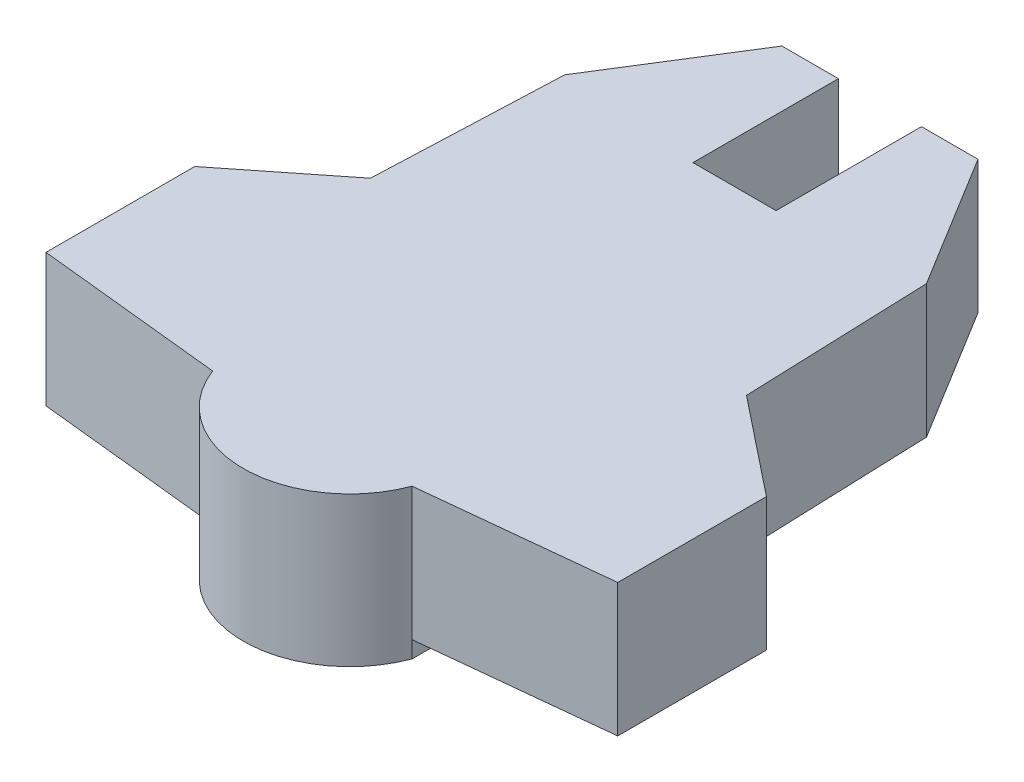
ISO-10303-21;
HEADER;
FILE_DESCRIPTION(('STEP AP214'),'2;1');
FILE_NAME('part.step','',(''),(''),'','','');
FILE_SCHEMA(('AUTOMOTIVE_DESIGN { 1 0 10303 214 1 1 1 1 }'));
ENDSEC;
DATA;
#1=APPLICATION_CONTEXT('core data for automotive mechanical design processes');
#2=APPLICATION_PROTOCOL_DEFINITION('international standard','automotive_design',2000,#1);
#3=PRODUCT_CONTEXT('',#1,'mechanical');
#4=PRODUCT('Part','Part','',(#3));
#5=PRODUCT_RELATED_PRODUCT_CATEGORY('part','',(#4));
#6=PRODUCT_DEFINITION_FORMATION('','',#4);
#7=PRODUCT_DEFINITION_CONTEXT('part definition',#1,'design');
#8=PRODUCT_DEFINITION('design','',#6,#7);
#9=PRODUCT_DEFINITION_SHAPE('','',#8);
#10=(LENGTH_UNIT() NAMED_UNIT(*) SI_UNIT(.MILLI.,.METRE.));
#11=(NAMED_UNIT(*) PLANE_ANGLE_UNIT() SI_UNIT($,.RADIAN.));
#12=(NAMED_UNIT(*) SI_UNIT($,.STERADIAN.) SOLID_ANGLE_UNIT());
#13=UNCERTAINTY_MEASURE_WITH_UNIT(LENGTH_MEASURE(1.E-05),#10,'distance_accuracy_value','');
#14=(GEOMETRIC_REPRESENTATION_CONTEXT(3) GLOBAL_UNCERTAINTY_ASSIGNED_CONTEXT((#13)) GLOBAL_UNIT_ASSIGNED_CONTEXT((#10,
#11,#12)) REPRESENTATION_CONTEXT('',''));
#15=CARTESIAN_POINT('',(0.,0.,0.));
#16=DIRECTION('',(0.,0.,1.));
#17=DIRECTION('',(1.,0.,0.));
#18=AXIS2_PLACEMENT_3D('',#15,#16,#17);
#19=CARTESIAN_POINT('',(21.4236315388932,9.,-58.3331963393979));
#20=DIRECTION('',(0.103828722380612,0.,-0.994595192230894));
#21=DIRECTION('',(-0.994595192230895,0.,-0.103828722380612));
#22=AXIS2_PLACEMENT_3D('',#19,#20,#21);
#23=PLANE('',#22);
#24=DIRECTION('',(0.,-1.,0.));
#25=VECTOR('',#24,1.);
#26=CARTESIAN_POINT('',(21.4236315388932,9.,-58.3331963393979));
#27=LINE('',#26,#25);
#28=CARTESIAN_POINT('',(21.4236315388932,9.,-58.3331963393979));
#29=VERTEX_POINT('',#28);
#30=CARTESIAN_POINT('',(21.4236315388932,1.,-58.3331963393979));
#31=VERTEX_POINT('',#30);
#32=EDGE_CURVE('E41',#29,#31,#27,.T.);
#33=ORIENTED_EDGE('',*,*,#32,.T.);
#34=DIRECTION('',(-0.994595192230894,0.,-0.103828722380612));
#35=VECTOR('',#34,1.);
#36=CARTESIAN_POINT('',(32.6236315388932,1.,-57.1639953421012));
#37=LINE('',#36,#35);
#38=CARTESIAN_POINT('',(32.6236315388932,1.,-57.1639953421012));
#39=VERTEX_POINT('',#38);
#40=EDGE_CURVE('E208',#39,#31,#37,.T.);
#41=ORIENTED_EDGE('',*,*,#40,.F.);
#42=DIRECTION('',(0.,-1.,0.));
#43=VECTOR('',#42,1.);
#44=CARTESIAN_POINT('',(32.6236315388932,9.,-57.1639953421012));
#45=LINE('',#44,#43);
#46=CARTESIAN_POINT('',(32.6236315388932,9.,-57.1639953421012));
#47=VERTEX_POINT('',#46);
#48=EDGE_CURVE('E200',#47,#39,#45,.T.);
#49=ORIENTED_EDGE('',*,*,#48,.F.);
#50=DIRECTION('',(0.994595192230894,0.,0.103828722380612));
#51=VECTOR('',#50,1.);
#52=CARTESIAN_POINT('',(21.4236315388932,9.,-58.3331963393979));
#53=LINE('',#52,#51);
#54=EDGE_CURVE('E209',#29,#47,#53,.T.);
#55=ORIENTED_EDGE('',*,*,#54,.F.);
#56=EDGE_LOOP('',(#33,#41,#49,#55));
#57=FACE_BOUND('',#56,.T.);
#58=ADVANCED_FACE('F33',(#57),#23,.F.);
#59=CARTESIAN_POINT('',(38.6236315388932,9.,-59.411070601111));
#60=DIRECTION('',(0.,-1.,0.));
#61=DIRECTION('',(0.,0.,-1.));
#62=AXIS2_PLACEMENT_3D('',#59,#60,#61);
#63=CYLINDRICAL_SURFACE('',#62,6.40697644912589);
#64=CARTESIAN_POINT('',(38.6236315388932,0.,-59.411070601111));
#65=DIRECTION('',(0.,1.,0.));
#66=DIRECTION('',(0.,0.,1.));
#67=AXIS2_PLACEMENT_3D('',#64,#65,#66);
#68=CIRCLE('',#67,6.40697644912589);
#69=CARTESIAN_POINT('',(32.6236315388932,0.,-57.1639953421012));
#70=VERTEX_POINT('',#69);
#71=CARTESIAN_POINT('',(44.6236315388932,0.,-57.1639953421013));
#72=VERTEX_POINT('',#71);
#73=EDGE_CURVE('E160',#70,#72,#68,.T.);
#74=ORIENTED_EDGE('',*,*,#73,.T.);
#75=DIRECTION('',(0.,-1.,0.));
#76=VECTOR('',#75,1.);
#77=CARTESIAN_POINT('',(44.6236315388932,1.,-57.1639953421013));
#78=LINE('',#77,#76);
#79=CARTESIAN_POINT('',(44.6236315388932,1.,-57.1639953421013));
#80=VERTEX_POINT('',#79);
#81=EDGE_CURVE('E62',#80,#72,#78,.T.);
#82=ORIENTED_EDGE('',*,*,#81,.F.);
#83=DIRECTION('',(0.,-1.,0.));
#84=VECTOR('',#83,1.);
#85=CARTESIAN_POINT('',(44.6236315388932,9.,-57.1639953421013));
#86=LINE('',#85,#84);
#87=CARTESIAN_POINT('',(44.6236315388932,9.,-57.1639953421013));
#88=VERTEX_POINT('',#87);
#89=EDGE_CURVE('E197',#88,#80,#86,.T.);
#90=ORIENTED_EDGE('',*,*,#89,.F.);
#91=CARTESIAN_POINT('',(38.6236315388932,9.,-59.411070601111));
#92=DIRECTION('',(0.,1.,0.));
#93=DIRECTION('',(0.,0.,1.));
#94=AXIS2_PLACEMENT_3D('',#91,#92,#93);
#95=CIRCLE('',#94,6.40697644912589);
#96=EDGE_CURVE('E254',#47,#88,#95,.T.);
#97=ORIENTED_EDGE('',*,*,#96,.F.);
#98=ORIENTED_EDGE('',*,*,#48,.T.);
#99=DIRECTION('',(0.,-1.,0.));
#100=VECTOR('',#99,1.);
#101=CARTESIAN_POINT('',(32.6236315388932,1.,-57.1639953421012));
#102=LINE('',#101,#100);
#103=EDGE_CURVE('E239',#39,#70,#102,.T.);
#104=ORIENTED_EDGE('',*,*,#103,.T.);
#105=EDGE_LOOP('',(#74,#82,#90,#97,#98,#104));
#106=FACE_BOUND('',#105,.T.);
#107=ADVANCED_FACE('F343',(#106),#63,.T.);
#108=CARTESIAN_POINT('',(55.8236315388932,9.,-58.3331963393979));
#109=DIRECTION('',(-0.103828722380611,0.,-0.994595192230894));
#110=DIRECTION('',(-0.994595192230895,0.,0.103828722380611));
#111=AXIS2_PLACEMENT_3D('',#108,#109,#110);
#112=PLANE('',#111);
#113=ORIENTED_EDGE('',*,*,#89,.T.);
#114=DIRECTION('',(-0.994595192230895,0.,0.103828722380611));
#115=VECTOR('',#114,1.);
#116=CARTESIAN_POINT('',(55.8236315388932,1.,-58.3331963393979));
#117=LINE('',#116,#115);
#118=CARTESIAN_POINT('',(55.8236315388932,1.,-58.3331963393979));
#119=VERTEX_POINT('',#118);
#120=EDGE_CURVE('E331',#119,#80,#117,.T.);
#121=ORIENTED_EDGE('',*,*,#120,.F.);
#122=DIRECTION('',(0.,-1.,0.));
#123=VECTOR('',#122,1.);
#124=CARTESIAN_POINT('',(55.8236315388932,9.,-58.3331963393979));
#125=LINE('',#124,#123);
#126=CARTESIAN_POINT('',(55.8236315388932,9.,-58.3331963393979));
#127=VERTEX_POINT('',#126);
#128=EDGE_CURVE('E194',#127,#119,#125,.T.);
#129=ORIENTED_EDGE('',*,*,#128,.F.);
#130=DIRECTION('',(0.994595192230895,0.,-0.103828722380611));
#131=VECTOR('',#130,1.);
#132=CARTESIAN_POINT('',(55.8236315388932,9.,-58.3331963393979));
#133=LINE('',#132,#131);
#134=EDGE_CURVE('E256',#88,#127,#133,.T.);
#135=ORIENTED_EDGE('',*,*,#134,.F.);
#136=EDGE_LOOP('',(#113,#121,#129,#135));
#137=FACE_BOUND('',#136,.T.);
#138=ADVANCED_FACE('F348',(#137),#112,.F.);
#139=CARTESIAN_POINT('',(55.8236315388932,9.,-67.2801257100161));
#140=DIRECTION('',(-1.,0.,0.));
#141=DIRECTION('',(0.,0.,1.));
#142=AXIS2_PLACEMENT_3D('',#139,#140,#141);
#143=PLANE('',#142);
#144=ORIENTED_EDGE('',*,*,#128,.T.);
#145=DIRECTION('',(0.,0.,1.));
#146=VECTOR('',#145,1.);
#147=CARTESIAN_POINT('',(55.8236315388932,1.,-67.2801257100161));
#148=LINE('',#147,#146);
#149=CARTESIAN_POINT('',(55.8236315388932,1.,-67.2801257100161));
#150=VERTEX_POINT('',#149);
#151=EDGE_CURVE('E336',#150,#119,#148,.T.);
#152=ORIENTED_EDGE('',*,*,#151,.F.);
#153=DIRECTION('',(0.,-1.,0.));
#154=VECTOR('',#153,1.);
#155=CARTESIAN_POINT('',(55.8236315388932,9.,-67.2801257100161));
#156=LINE('',#155,#154);
#157=CARTESIAN_POINT('',(55.8236315388932,9.,-67.2801257100161));
#158=VERTEX_POINT('',#157);
#159=EDGE_CURVE('E191',#158,#150,#156,.T.);
#160=ORIENTED_EDGE('',*,*,#159,.F.);
#161=DIRECTION('',(0.,0.,-1.));
#162=VECTOR('',#161,1.);
#163=CARTESIAN_POINT('',(55.8236315388932,9.,-67.2801257100161));
#164=LINE('',#163,#162);
#165=EDGE_CURVE('E258',#127,#158,#164,.T.);
#166=ORIENTED_EDGE('',*,*,#165,.F.);
#167=EDGE_LOOP('',(#144,#152,#160,#166));
#168=FACE_BOUND('',#167,.T.);
#169=ADVANCED_FACE('F397',(#168),#143,.F.);
#170=CARTESIAN_POINT('',(49.9482892828328,9.,-71.9569296992029));
#171=DIRECTION('',(-0.622787478423044,0.,0.7823910510221));
#172=DIRECTION('',(0.7823910510221,0.,0.622787478423044));
#173=AXIS2_PLACEMENT_3D('',#170,#171,#172);
#174=PLANE('',#173);
#175=ORIENTED_EDGE('',*,*,#159,.T.);
#176=DIRECTION('',(0.7823910510221,0.,0.622787478423044));
#177=VECTOR('',#176,1.);
#178=CARTESIAN_POINT('',(49.9482892828328,1.,-71.9569296992029));
#179=LINE('',#178,#177);
#180=CARTESIAN_POINT('',(49.9482892828328,1.,-71.9569296992029));
#181=VERTEX_POINT('',#180);
#182=EDGE_CURVE('E391',#181,#150,#179,.T.);
#183=ORIENTED_EDGE('',*,*,#182,.F.);
#184=DIRECTION('',(0.,-1.,0.));
#185=VECTOR('',#184,1.);
#186=CARTESIAN_POINT('',(49.9482892828328,9.,-71.9569296992029));
#187=LINE('',#186,#185);
#188=CARTESIAN_POINT('',(49.9482892828328,9.,-71.9569296992029));
#189=VERTEX_POINT('',#188);
#190=EDGE_CURVE('E188',#189,#181,#187,.T.);
#191=ORIENTED_EDGE('',*,*,#190,.F.);
#192=DIRECTION('',(-0.7823910510221,0.,-0.622787478423044));
#193=VECTOR('',#192,1.);
#194=CARTESIAN_POINT('',(49.9482892828328,9.,-71.9569296992029));
#195=LINE('',#194,#193);
#196=EDGE_CURVE('E260',#158,#189,#195,.T.);
#197=ORIENTED_EDGE('',*,*,#196,.F.);
#198=EDGE_LOOP('',(#175,#183,#191,#197));
#199=FACE_BOUND('',#198,.T.);
#200=ADVANCED_FACE('F399',(#199),#174,.F.);
#201=CARTESIAN_POINT('',(49.5416106750775,9.,-83.191426238445));
#202=DIRECTION('',(-0.999345455962925,0.,0.0361754011208295));
#203=DIRECTION('',(0.0361754011208295,0.,0.999345455962925));
#204=AXIS2_PLACEMENT_3D('',#201,#202,#203);
#205=PLANE('',#204);
#206=ORIENTED_EDGE('',*,*,#190,.T.);
#207=DIRECTION('',(0.0361754011208295,0.,0.999345455962925));
#208=VECTOR('',#207,1.);
#209=CARTESIAN_POINT('',(49.5416106750775,1.,-83.191426238445));
#210=LINE('',#209,#208);
#211=CARTESIAN_POINT('',(49.5416106750775,1.,-83.191426238445));
#212=VERTEX_POINT('',#211);
#213=EDGE_CURVE('E390',#212,#181,#210,.T.);
#214=ORIENTED_EDGE('',*,*,#213,.F.);
#215=DIRECTION('',(0.,-1.,0.));
#216=VECTOR('',#215,1.);
#217=CARTESIAN_POINT('',(49.5416106750775,9.,-83.191426238445));
#218=LINE('',#217,#216);
#219=CARTESIAN_POINT('',(49.5416106750775,9.,-83.191426238445));
#220=VERTEX_POINT('',#219);
#221=EDGE_CURVE('E185',#220,#212,#218,.T.);
#222=ORIENTED_EDGE('',*,*,#221,.F.);
#223=DIRECTION('',(-0.0361754011208295,0.,-0.999345455962925));
#224=VECTOR('',#223,1.);
#225=CARTESIAN_POINT('',(49.5416106750775,9.,-83.191426238445));
#226=LINE('',#225,#224);
#227=EDGE_CURVE('E262',#189,#220,#226,.T.);
#228=ORIENTED_EDGE('',*,*,#227,.F.);
#229=EDGE_LOOP('',(#206,#214,#222,#228));
#230=FACE_BOUND('',#229,.T.);
#231=ADVANCED_FACE('F405',(#230),#205,.F.);
#232=CARTESIAN_POINT('',(44.6106325560436,9.,-91.2233287416136));
#233=DIRECTION('',(-0.852213418177229,0.,0.523194313691083));
#234=DIRECTION('',(0.523194313691083,0.,0.852213418177229));
#235=AXIS2_PLACEMENT_3D('',#232,#233,#234);
#236=PLANE('',#235);
#237=ORIENTED_EDGE('',*,*,#221,.T.);
#238=DIRECTION('',(0.523194313691083,0.,0.852213418177229));
#239=VECTOR('',#238,1.);
#240=CARTESIAN_POINT('',(44.6106325560436,1.,-91.2233287416136));
#241=LINE('',#240,#239);
#242=CARTESIAN_POINT('',(44.6106325560436,1.,-91.2233287416136));
#243=VERTEX_POINT('',#242);
#244=EDGE_CURVE('E386',#243,#212,#241,.T.);
#245=ORIENTED_EDGE('',*,*,#244,.F.);
#246=DIRECTION('',(0.,-1.,0.));
#247=VECTOR('',#246,1.);
#248=CARTESIAN_POINT('',(44.6106325560436,9.,-91.2233287416136));
#249=LINE('',#248,#247);
#250=CARTESIAN_POINT('',(44.6106325560436,9.,-91.2233287416136));
#251=VERTEX_POINT('',#250);
#252=EDGE_CURVE('E182',#251,#243,#249,.T.);
#253=ORIENTED_EDGE('',*,*,#252,.F.);
#254=DIRECTION('',(-0.523194313691083,0.,-0.852213418177229));
#255=VECTOR('',#254,1.);
#256=CARTESIAN_POINT('',(44.6106325560436,9.,-91.2233287416136));
#257=LINE('',#256,#255);
#258=EDGE_CURVE('E264',#220,#251,#257,.T.);
#259=ORIENTED_EDGE('',*,*,#258,.F.);
#260=EDGE_LOOP('',(#237,#245,#253,#259));
#261=FACE_BOUND('',#260,.T.);
#262=ADVANCED_FACE('F408',(#261),#236,.F.);
#263=CARTESIAN_POINT('',(41.2106325560436,9.,-91.2233287416136));
#264=DIRECTION('',(0.,0.,1.));
#265=DIRECTION('',(1.,0.,0.));
#266=AXIS2_PLACEMENT_3D('',#263,#264,#265);
#267=PLANE('',#266);
#268=ORIENTED_EDGE('',*,*,#252,.T.);
#269=DIRECTION('',(1.,0.,0.));
#270=VECTOR('',#269,1.);
#271=CARTESIAN_POINT('',(41.2106325560436,1.,-91.2233287416136));
#272=LINE('',#271,#270);
#273=CARTESIAN_POINT('',(41.2106325560436,1.,-91.2233287416136));
#274=VERTEX_POINT('',#273);
#275=EDGE_CURVE('E384',#274,#243,#272,.T.);
#276=ORIENTED_EDGE('',*,*,#275,.F.);
#277=DIRECTION('',(0.,-1.,0.));
#278=VECTOR('',#277,1.);
#279=CARTESIAN_POINT('',(41.2106325560436,9.,-91.2233287416136));
#280=LINE('',#279,#278);
#281=CARTESIAN_POINT('',(41.2106325560436,9.,-91.2233287416136));
#282=VERTEX_POINT('',#281);
#283=EDGE_CURVE('E179',#282,#274,#280,.T.);
#284=ORIENTED_EDGE('',*,*,#283,.F.);
#285=DIRECTION('',(-1.,0.,0.));
#286=VECTOR('',#285,1.);
#287=CARTESIAN_POINT('',(41.2106325560436,9.,-91.2233287416136));
#288=LINE('',#287,#286);
#289=EDGE_CURVE('E266',#251,#282,#288,.T.);
#290=ORIENTED_EDGE('',*,*,#289,.F.);
#291=EDGE_LOOP('',(#268,#276,#284,#290));
#292=FACE_BOUND('',#291,.T.);
#293=ADVANCED_FACE('F411',(#292),#267,.F.);
#294=CARTESIAN_POINT('',(41.2106325560436,9.,-82.4733287416136));
#295=DIRECTION('',(1.,0.,0.));
#296=DIRECTION('',(0.,0.,-1.));
#297=AXIS2_PLACEMENT_3D('',#294,#295,#296);
#298=PLANE('',#297);
#299=ORIENTED_EDGE('',*,*,#283,.T.);
#300=DIRECTION('',(0.,0.,-1.));
#301=VECTOR('',#300,1.);
#302=CARTESIAN_POINT('',(41.2106325560436,1.,-82.4733287416136));
#303=LINE('',#302,#301);
#304=CARTESIAN_POINT('',(41.2106325560436,1.,-82.4733287416136));
#305=VERTEX_POINT('',#304);
#306=EDGE_CURVE('E377',#305,#274,#303,.T.);
#307=ORIENTED_EDGE('',*,*,#306,.F.);
#308=DIRECTION('',(0.,-1.,0.));
#309=VECTOR('',#308,1.);
#310=CARTESIAN_POINT('',(41.2106325560436,9.,-82.4733287416136));
#311=LINE('',#310,#309);
#312=CARTESIAN_POINT('',(41.2106325560436,9.,-82.4733287416136));
#313=VERTEX_POINT('',#312);
#314=EDGE_CURVE('E176',#313,#305,#311,.T.);
#315=ORIENTED_EDGE('',*,*,#314,.F.);
#316=DIRECTION('',(0.,0.,1.));
#317=VECTOR('',#316,1.);
#318=CARTESIAN_POINT('',(41.2106325560436,9.,-82.4733287416136));
#319=LINE('',#318,#317);
#320=EDGE_CURVE('E268',#282,#313,#319,.T.);
#321=ORIENTED_EDGE('',*,*,#320,.F.);
#322=EDGE_LOOP('',(#299,#307,#315,#321));
#323=FACE_BOUND('',#322,.T.);
#324=ADVANCED_FACE('F381',(#323),#298,.F.);
#325=CARTESIAN_POINT('',(36.2106325560436,9.,-82.4733287416136));
#326=DIRECTION('',(0.,0.,1.));
#327=DIRECTION('',(1.,0.,0.));
#328=AXIS2_PLACEMENT_3D('',#325,#326,#327);
#329=PLANE('',#328);
#330=DIRECTION('',(-1.,0.,0.));
#331=VECTOR('',#330,1.);
#332=CARTESIAN_POINT('',(36.2106325560436,0.,-82.4733287416136));
#333=LINE('',#332,#331);
#334=CARTESIAN_POINT('',(41.2106325560436,0.,-82.4733287416136));
#335=VERTEX_POINT('',#334);
#336=CARTESIAN_POINT('',(36.2106325560436,0.,-82.4733287416136));
#337=VERTEX_POINT('',#336);
#338=EDGE_CURVE('E163',#335,#337,#333,.T.);
#339=ORIENTED_EDGE('',*,*,#338,.T.);
#340=DIRECTION('',(0.,-1.,0.));
#341=VECTOR('',#340,1.);
#342=CARTESIAN_POINT('',(36.2106325560436,1.,-82.4733287416136));
#343=LINE('',#342,#341);
#344=CARTESIAN_POINT('',(36.2106325560436,1.,-82.4733287416136));
#345=VERTEX_POINT('',#344);
#346=EDGE_CURVE('E246',#345,#337,#343,.T.);
#347=ORIENTED_EDGE('',*,*,#346,.F.);
#348=DIRECTION('',(0.,-1.,0.));
#349=VECTOR('',#348,1.);
#350=CARTESIAN_POINT('',(36.2106325560436,9.,-82.4733287416136));
#351=LINE('',#350,#349);
#352=CARTESIAN_POINT('',(36.2106325560436,9.,-82.4733287416136));
#353=VERTEX_POINT('',#352);
#354=EDGE_CURVE('E173',#353,#345,#351,.T.);
#355=ORIENTED_EDGE('',*,*,#354,.F.);
#356=DIRECTION('',(-1.,0.,0.));
#357=VECTOR('',#356,1.);
#358=CARTESIAN_POINT('',(36.2106325560436,9.,-82.4733287416136));
#359=LINE('',#358,#357);
#360=EDGE_CURVE('E270',#313,#353,#359,.T.);
#361=ORIENTED_EDGE('',*,*,#360,.F.);
#362=ORIENTED_EDGE('',*,*,#314,.T.);
#363=DIRECTION('',(0.,-1.,0.));
#364=VECTOR('',#363,1.);
#365=CARTESIAN_POINT('',(41.2106325560436,1.,-82.4733287416136));
#366=LINE('',#365,#364);
#367=EDGE_CURVE('E243',#305,#335,#366,.T.);
#368=ORIENTED_EDGE('',*,*,#367,.T.);
#369=EDGE_LOOP('',(#339,#347,#355,#361,#362,#368));
#370=FACE_BOUND('',#369,.T.);
#371=ADVANCED_FACE('F372',(#370),#329,.F.);
#372=CARTESIAN_POINT('',(36.2106325560436,9.,-91.2233287416136));
#373=DIRECTION('',(-1.,0.,0.));
#374=DIRECTION('',(0.,0.,1.));
#375=AXIS2_PLACEMENT_3D('',#372,#373,#374);
#376=PLANE('',#375);
#377=ORIENTED_EDGE('',*,*,#354,.T.);
#378=DIRECTION('',(0.,0.,1.));
#379=VECTOR('',#378,1.);
#380=CARTESIAN_POINT('',(36.2106325560436,1.,-91.2233287416136));
#381=LINE('',#380,#379);
#382=CARTESIAN_POINT('',(36.2106325560436,1.,-91.2233287416136));
#383=VERTEX_POINT('',#382);
#384=EDGE_CURVE('E234',#383,#345,#381,.T.);
#385=ORIENTED_EDGE('',*,*,#384,.F.);
#386=DIRECTION('',(0.,-1.,0.));
#387=VECTOR('',#386,1.);
#388=CARTESIAN_POINT('',(36.2106325560436,9.,-91.2233287416136));
#389=LINE('',#388,#387);
#390=CARTESIAN_POINT('',(36.2106325560436,9.,-91.2233287416136));
#391=VERTEX_POINT('',#390);
#392=EDGE_CURVE('E170',#391,#383,#389,.T.);
#393=ORIENTED_EDGE('',*,*,#392,.F.);
#394=DIRECTION('',(0.,0.,-1.));
#395=VECTOR('',#394,1.);
#396=CARTESIAN_POINT('',(36.2106325560436,9.,-91.2233287416136));
#397=LINE('',#396,#395);
#398=EDGE_CURVE('E272',#353,#391,#397,.T.);
#399=ORIENTED_EDGE('',*,*,#398,.F.);
#400=EDGE_LOOP('',(#377,#385,#393,#399));
#401=FACE_BOUND('',#400,.T.);
#402=ADVANCED_FACE('F279',(#401),#376,.F.);
#403=CARTESIAN_POINT('',(32.8106325560436,9.,-91.2233287416136));
#404=DIRECTION('',(0.,0.,1.));
#405=DIRECTION('',(1.,0.,0.));
#406=AXIS2_PLACEMENT_3D('',#403,#404,#405);
#407=PLANE('',#406);
#408=ORIENTED_EDGE('',*,*,#392,.T.);
#409=DIRECTION('',(1.,0.,0.));
#410=VECTOR('',#409,1.);
#411=CARTESIAN_POINT('',(32.8106325560436,1.,-91.2233287416136));
#412=LINE('',#411,#410);
#413=CARTESIAN_POINT('',(32.8106325560436,1.,-91.2233287416136));
#414=VERTEX_POINT('',#413);
#415=EDGE_CURVE('E231',#414,#383,#412,.T.);
#416=ORIENTED_EDGE('',*,*,#415,.F.);
#417=DIRECTION('',(0.,-1.,0.));
#418=VECTOR('',#417,1.);
#419=CARTESIAN_POINT('',(32.8106325560436,9.,-91.2233287416136));
#420=LINE('',#419,#418);
#421=CARTESIAN_POINT('',(32.8106325560436,9.,-91.2233287416136));
#422=VERTEX_POINT('',#421);
#423=EDGE_CURVE('E148',#422,#414,#420,.T.);
#424=ORIENTED_EDGE('',*,*,#423,.F.);
#425=DIRECTION('',(-1.,0.,0.));
#426=VECTOR('',#425,1.);
#427=CARTESIAN_POINT('',(32.8106325560436,9.,-91.2233287416136));
#428=LINE('',#427,#426);
#429=EDGE_CURVE('E134',#391,#422,#428,.T.);
#430=ORIENTED_EDGE('',*,*,#429,.F.);
#431=EDGE_LOOP('',(#408,#416,#424,#430));
#432=FACE_BOUND('',#431,.T.);
#433=ADVANCED_FACE('F282',(#432),#407,.F.);
#434=CARTESIAN_POINT('',(27.7779847850709,9.,-83.191426238445));
#435=DIRECTION('',(0.847395142335866,0.,0.530962779058549));
#436=DIRECTION('',(0.530962779058549,0.,-0.847395142335866));
#437=AXIS2_PLACEMENT_3D('',#434,#435,#436);
#438=PLANE('',#437);
#439=ORIENTED_EDGE('',*,*,#423,.T.);
#440=DIRECTION('',(0.530962779058549,0.,-0.847395142335866));
#441=VECTOR('',#440,1.);
#442=CARTESIAN_POINT('',(27.7779847850709,1.,-83.191426238445));
#443=LINE('',#442,#441);
#444=CARTESIAN_POINT('',(27.7779847850709,1.,-83.191426238445));
#445=VERTEX_POINT('',#444);
#446=EDGE_CURVE('E145',#445,#414,#443,.T.);
#447=ORIENTED_EDGE('',*,*,#446,.F.);
#448=DIRECTION('',(0.,-1.,0.));
#449=VECTOR('',#448,1.);
#450=CARTESIAN_POINT('',(27.7779847850709,9.,-83.191426238445));
#451=LINE('',#450,#449);
#452=CARTESIAN_POINT('',(27.7779847850709,9.,-83.191426238445));
#453=VERTEX_POINT('',#452);
#454=EDGE_CURVE('E141',#453,#445,#451,.T.);
#455=ORIENTED_EDGE('',*,*,#454,.F.);
#456=DIRECTION('',(-0.530962779058549,0.,0.847395142335866));
#457=VECTOR('',#456,1.);
#458=CARTESIAN_POINT('',(27.7779847850709,9.,-83.191426238445));
#459=LINE('',#458,#457);
#460=EDGE_CURVE('E127',#422,#453,#459,.T.);
#461=ORIENTED_EDGE('',*,*,#460,.F.);
#462=EDGE_LOOP('',(#439,#447,#455,#461));
#463=FACE_BOUND('',#462,.T.);
#464=ADVANCED_FACE('F142',(#463),#438,.F.);
#465=CARTESIAN_POINT('',(27.3204713513461,9.,-71.9569296992029));
#466=DIRECTION('',(0.999171808637776,0.,0.0406902546504071));
#467=DIRECTION('',(0.0406902546504071,0.,-0.999171808637776));
#468=AXIS2_PLACEMENT_3D('',#465,#466,#467);
#469=PLANE('',#468);
#470=ORIENTED_EDGE('',*,*,#454,.T.);
#471=DIRECTION('',(0.0406902546504071,0.,-0.999171808637776));
#472=VECTOR('',#471,1.);
#473=CARTESIAN_POINT('',(27.3204713513461,1.,-71.9569296992029));
#474=LINE('',#473,#472);
#475=CARTESIAN_POINT('',(27.3204713513461,1.,-71.9569296992029));
#476=VERTEX_POINT('',#475);
#477=EDGE_CURVE('E222',#476,#445,#474,.T.);
#478=ORIENTED_EDGE('',*,*,#477,.F.);
#479=DIRECTION('',(0.,-1.,0.));
#480=VECTOR('',#479,1.);
#481=CARTESIAN_POINT('',(27.3204713513461,9.,-71.9569296992029));
#482=LINE('',#481,#480);
#483=CARTESIAN_POINT('',(27.3204713513461,9.,-71.9569296992029));
#484=VERTEX_POINT('',#483);
#485=EDGE_CURVE('E149',#484,#476,#482,.T.);
#486=ORIENTED_EDGE('',*,*,#485,.F.);
#487=DIRECTION('',(-0.0406902546504071,0.,0.999171808637776));
#488=VECTOR('',#487,1.);
#489=CARTESIAN_POINT('',(27.3204713513461,9.,-71.9569296992029));
#490=LINE('',#489,#488);
#491=EDGE_CURVE('E131',#453,#484,#490,.T.);
#492=ORIENTED_EDGE('',*,*,#491,.F.);
#493=EDGE_LOOP('',(#470,#478,#486,#492));
#494=FACE_BOUND('',#493,.T.);
#495=ADVANCED_FACE('F151',(#494),#469,.F.);
#496=CARTESIAN_POINT('',(21.4236315388932,9.,-67.2801257100161));
#497=DIRECTION('',(0.621394711002043,0.,0.783497679089534));
#498=DIRECTION('',(0.783497679089534,0.,-0.621394711002043));
#499=AXIS2_PLACEMENT_3D('',#496,#497,#498);
#500=PLANE('',#499);
#501=ORIENTED_EDGE('',*,*,#485,.T.);
#502=DIRECTION('',(0.783497679089534,0.,-0.621394711002043));
#503=VECTOR('',#502,1.);
#504=CARTESIAN_POINT('',(21.4236315388932,1.,-67.2801257100161));
#505=LINE('',#504,#503);
#506=CARTESIAN_POINT('',(21.4236315388932,1.,-67.2801257100161));
#507=VERTEX_POINT('',#506);
#508=EDGE_CURVE('E220',#507,#476,#505,.T.);
#509=ORIENTED_EDGE('',*,*,#508,.F.);
#510=DIRECTION('',(0.,-1.,0.));
#511=VECTOR('',#510,1.);
#512=CARTESIAN_POINT('',(21.4236315388932,9.,-67.2801257100161));
#513=LINE('',#512,#511);
#514=CARTESIAN_POINT('',(21.4236315388932,9.,-67.2801257100161));
#515=VERTEX_POINT('',#514);
#516=EDGE_CURVE('E156',#515,#507,#513,.T.);
#517=ORIENTED_EDGE('',*,*,#516,.F.);
#518=DIRECTION('',(-0.783497679089534,0.,0.621394711002043));
#519=VECTOR('',#518,1.);
#520=CARTESIAN_POINT('',(21.4236315388932,9.,-67.2801257100161));
#521=LINE('',#520,#519);
#522=EDGE_CURVE('E154',#484,#515,#521,.T.);
#523=ORIENTED_EDGE('',*,*,#522,.F.);
#524=EDGE_LOOP('',(#501,#509,#517,#523));
#525=FACE_BOUND('',#524,.T.);
#526=ADVANCED_FACE('F494',(#525),#500,.F.);
#527=CARTESIAN_POINT('',(21.4236315388932,9.,-59.7565714665417));
#528=DIRECTION('',(1.,0.,0.));
#529=DIRECTION('',(0.,0.,-1.));
#530=AXIS2_PLACEMENT_3D('',#527,#528,#529);
#531=PLANE('',#530);
#532=ORIENTED_EDGE('',*,*,#516,.T.);
#533=DIRECTION('',(0.,0.,-1.));
#534=VECTOR('',#533,1.);
#535=CARTESIAN_POINT('',(21.4236315388932,1.,-58.3331963393979));
#536=LINE('',#535,#534);
#537=EDGE_CURVE('E215',#31,#507,#536,.T.);
#538=ORIENTED_EDGE('',*,*,#537,.F.);
#539=ORIENTED_EDGE('',*,*,#32,.F.);
#540=DIRECTION('',(0.,0.,1.));
#541=VECTOR('',#540,1.);
#542=CARTESIAN_POINT('',(21.4236315388932,9.,-59.7565714665417));
#543=LINE('',#542,#541);
#544=EDGE_CURVE('E49',#515,#29,#543,.T.);
#545=ORIENTED_EDGE('',*,*,#544,.F.);
#546=EDGE_LOOP('',(#532,#538,#539,#545));
#547=FACE_BOUND('',#546,.T.);
#548=ADVANCED_FACE('F213',(#547),#531,.F.);
#549=CARTESIAN_POINT('',(38.6236315388932,9.,-59.411070601111));
#550=DIRECTION('',(0.,1.,0.));
#551=DIRECTION('',(0.,0.,1.));
#552=AXIS2_PLACEMENT_3D('',#549,#550,#551);
#553=PLANE('',#552);
#554=ORIENTED_EDGE('',*,*,#544,.T.);
#555=ORIENTED_EDGE('',*,*,#54,.T.);
#556=ORIENTED_EDGE('',*,*,#96,.T.);
#557=ORIENTED_EDGE('',*,*,#134,.T.);
#558=ORIENTED_EDGE('',*,*,#165,.T.);
#559=ORIENTED_EDGE('',*,*,#196,.T.);
#560=ORIENTED_EDGE('',*,*,#227,.T.);
#561=ORIENTED_EDGE('',*,*,#258,.T.);
#562=ORIENTED_EDGE('',*,*,#289,.T.);
#563=ORIENTED_EDGE('',*,*,#320,.T.);
#564=ORIENTED_EDGE('',*,*,#360,.T.);
#565=ORIENTED_EDGE('',*,*,#398,.T.);
#566=ORIENTED_EDGE('',*,*,#429,.T.);
#567=ORIENTED_EDGE('',*,*,#460,.T.);
#568=ORIENTED_EDGE('',*,*,#491,.T.);
#569=ORIENTED_EDGE('',*,*,#522,.T.);
#570=EDGE_LOOP('',(#554,#555,#556,#557,#558,#559,#560,#561,#562,#563,#564,#565,#566,#567,#568,#569));
#571=FACE_BOUND('',#570,.T.);
#572=ADVANCED_FACE('F129',(#571),#553,.T.);
#573=CARTESIAN_POINT('',(38.6236315388932,0.,-59.411070601111));
#574=DIRECTION('',(0.,1.,0.));
#575=DIRECTION('',(0.,0.,1.));
#576=AXIS2_PLACEMENT_3D('',#573,#574,#575);
#577=PLANE('',#576);
#578=CARTESIAN_POINT('',(38.670089984362,0.,-68.740632333165));
#579=DIRECTION('',(0.,1.,0.));
#580=DIRECTION('',(0.,0.,1.));
#581=AXIS2_PLACEMENT_3D('',#578,#579,#580);
#582=CIRCLE('',#581,2.5);
#583=CARTESIAN_POINT('',(38.670089984362,0.,-66.240632333165));
#584=VERTEX_POINT('',#583);
#585=EDGE_CURVE('E11',#584,#584,#582,.F.);
#586=ORIENTED_EDGE('',*,*,#585,.F.);
#587=EDGE_LOOP('',(#586));
#588=FACE_BOUND('',#587,.T.);
#589=ORIENTED_EDGE('',*,*,#338,.F.);
#590=DIRECTION('',(-0.337922524427523,0.,-0.941173930516847));
#591=VECTOR('',#590,1.);
#592=CARTESIAN_POINT('',(44.6236315388932,0.,-72.9675236077877));
#593=LINE('',#592,#591);
#594=CARTESIAN_POINT('',(44.6236315388932,0.,-72.9675236077877));
#595=VERTEX_POINT('',#594);
#596=EDGE_CURVE('E339',#595,#335,#593,.T.);
#597=ORIENTED_EDGE('',*,*,#596,.F.);
#598=DIRECTION('',(0.,0.,-1.));
#599=VECTOR('',#598,1.);
#600=CARTESIAN_POINT('',(44.6236315388932,0.,-57.1639953421013));
#601=LINE('',#600,#599);
#602=EDGE_CURVE('E359',#72,#595,#601,.T.);
#603=ORIENTED_EDGE('',*,*,#602,.F.);
#604=ORIENTED_EDGE('',*,*,#73,.F.);
#605=DIRECTION('',(0.,0.,1.));
#606=VECTOR('',#605,1.);
#607=CARTESIAN_POINT('',(32.6236315388932,0.,-72.9675236077877));
#608=LINE('',#607,#606);
#609=CARTESIAN_POINT('',(32.6236315388932,0.,-72.9675236077877));
#610=VERTEX_POINT('',#609);
#611=EDGE_CURVE('E240',#610,#70,#608,.T.);
#612=ORIENTED_EDGE('',*,*,#611,.F.);
#613=DIRECTION('',(-0.353049045219663,0.,0.935604815971725));
#614=VECTOR('',#613,1.);
#615=CARTESIAN_POINT('',(36.2106325560436,0.,-82.4733287416136));
#616=LINE('',#615,#614);
#617=EDGE_CURVE('E242',#337,#610,#616,.T.);
#618=ORIENTED_EDGE('',*,*,#617,.F.);
#619=EDGE_LOOP('',(#589,#597,#603,#604,#612,#618));
#620=FACE_BOUND('',#619,.T.);
#621=ADVANCED_FACE('F356',(#588,#620),#577,.F.);
#622=CARTESIAN_POINT('',(38.670089984362,-6.,-68.740632333165));
#623=DIRECTION('',(0.,1.,0.));
#624=DIRECTION('',(0.,0.,1.));
#625=AXIS2_PLACEMENT_3D('',#622,#623,#624);
#626=CYLINDRICAL_SURFACE('',#625,2.5);
#627=CARTESIAN_POINT('',(38.670089984362,-6.,-68.740632333165));
#628=DIRECTION('',(0.,-1.,0.));
#629=DIRECTION('',(0.,0.,-1.));
#630=AXIS2_PLACEMENT_3D('',#627,#628,#629);
#631=CIRCLE('',#630,2.5);
#632=CARTESIAN_POINT('',(38.670089984362,-6.,-71.240632333165));
#633=VERTEX_POINT('',#632);
#634=EDGE_CURVE('E164',#633,#633,#631,.T.);
#635=ORIENTED_EDGE('',*,*,#634,.F.);
#636=EDGE_LOOP('',(#635));
#637=FACE_BOUND('',#636,.T.);
#638=ORIENTED_EDGE('',*,*,#585,.T.);
#639=EDGE_LOOP('',(#638));
#640=FACE_BOUND('',#639,.T.);
#641=ADVANCED_FACE('F528',(#637,#640),#626,.T.);
#642=CARTESIAN_POINT('',(38.670089984362,-6.,-68.740632333165));
#643=DIRECTION('',(0.,-1.,0.));
#644=DIRECTION('',(0.,0.,-1.));
#645=AXIS2_PLACEMENT_3D('',#642,#643,#644);
#646=PLANE('',#645);
#647=ORIENTED_EDGE('',*,*,#634,.T.);
#648=EDGE_LOOP('',(#647));
#649=FACE_BOUND('',#648,.T.);
#650=ADVANCED_FACE('F538',(#649),#646,.T.);
#651=CARTESIAN_POINT('',(32.6236315388932,1.,-72.9675236077877));
#652=DIRECTION('',(1.,0.,0.));
#653=DIRECTION('',(0.,0.,-1.));
#654=AXIS2_PLACEMENT_3D('',#651,#652,#653);
#655=PLANE('',#654);
#656=ORIENTED_EDGE('',*,*,#611,.T.);
#657=ORIENTED_EDGE('',*,*,#103,.F.);
#658=DIRECTION('',(0.,0.,1.));
#659=VECTOR('',#658,1.);
#660=CARTESIAN_POINT('',(32.6236315388932,1.,-72.9675236077877));
#661=LINE('',#660,#659);
#662=CARTESIAN_POINT('',(32.6236315388932,1.,-72.9675236077877));
#663=VERTEX_POINT('',#662);
#664=EDGE_CURVE('E224',#663,#39,#661,.T.);
#665=ORIENTED_EDGE('',*,*,#664,.F.);
#666=DIRECTION('',(0.,-1.,0.));
#667=VECTOR('',#666,1.);
#668=CARTESIAN_POINT('',(32.6236315388932,1.,-72.9675236077877));
#669=LINE('',#668,#667);
#670=EDGE_CURVE('E73',#663,#610,#669,.T.);
#671=ORIENTED_EDGE('',*,*,#670,.T.);
#672=EDGE_LOOP('',(#656,#657,#665,#671));
#673=FACE_BOUND('',#672,.T.);
#674=ADVANCED_FACE('F368',(#673),#655,.F.);
#675=CARTESIAN_POINT('',(36.2106325560436,1.,-82.4733287416136));
#676=DIRECTION('',(0.935604815971725,0.,0.353049045219663));
#677=DIRECTION('',(0.353049045219663,0.,-0.935604815971725));
#678=AXIS2_PLACEMENT_3D('',#675,#676,#677);
#679=PLANE('',#678);
#680=ORIENTED_EDGE('',*,*,#617,.T.);
#681=ORIENTED_EDGE('',*,*,#670,.F.);
#682=DIRECTION('',(-0.353049045219663,0.,0.935604815971725));
#683=VECTOR('',#682,1.);
#684=CARTESIAN_POINT('',(36.2106325560436,1.,-82.4733287416136));
#685=LINE('',#684,#683);
#686=EDGE_CURVE('E236',#345,#663,#685,.T.);
#687=ORIENTED_EDGE('',*,*,#686,.F.);
#688=ORIENTED_EDGE('',*,*,#346,.T.);
#689=EDGE_LOOP('',(#680,#681,#687,#688));
#690=FACE_BOUND('',#689,.T.);
#691=ADVANCED_FACE('F369',(#690),#679,.F.);
#692=CARTESIAN_POINT('',(0.,1.,0.));
#693=DIRECTION('',(0.,1.,0.));
#694=DIRECTION('',(0.,0.,1.));
#695=AXIS2_PLACEMENT_3D('',#692,#693,#694);
#696=PLANE('',#695);
#697=ORIENTED_EDGE('',*,*,#664,.T.);
#698=ORIENTED_EDGE('',*,*,#40,.T.);
#699=ORIENTED_EDGE('',*,*,#537,.T.);
#700=ORIENTED_EDGE('',*,*,#508,.T.);
#701=ORIENTED_EDGE('',*,*,#477,.T.);
#702=ORIENTED_EDGE('',*,*,#446,.T.);
#703=ORIENTED_EDGE('',*,*,#415,.T.);
#704=ORIENTED_EDGE('',*,*,#384,.T.);
#705=ORIENTED_EDGE('',*,*,#686,.T.);
#706=EDGE_LOOP('',(#697,#698,#699,#700,#701,#702,#703,#704,#705));
#707=FACE_BOUND('',#706,.T.);
#708=ADVANCED_FACE('F367',(#707),#696,.F.);
#709=CARTESIAN_POINT('',(44.6236315388932,1.,-72.9675236077877));
#710=DIRECTION('',(-0.941173930516847,0.,0.337922524427523));
#711=DIRECTION('',(0.337922524427523,0.,0.941173930516847));
#712=AXIS2_PLACEMENT_3D('',#709,#710,#711);
#713=PLANE('',#712);
#714=ORIENTED_EDGE('',*,*,#596,.T.);
#715=ORIENTED_EDGE('',*,*,#367,.F.);
#716=DIRECTION('',(-0.337922524427523,0.,-0.941173930516847));
#717=VECTOR('',#716,1.);
#718=CARTESIAN_POINT('',(44.6236315388932,1.,-72.9675236077877));
#719=LINE('',#718,#717);
#720=CARTESIAN_POINT('',(44.6236315388932,1.,-72.9675236077877));
#721=VERTEX_POINT('',#720);
#722=EDGE_CURVE('E330',#721,#305,#719,.T.);
#723=ORIENTED_EDGE('',*,*,#722,.F.);
#724=DIRECTION('',(0.,-1.,0.));
#725=VECTOR('',#724,1.);
#726=CARTESIAN_POINT('',(44.6236315388932,1.,-72.9675236077877));
#727=LINE('',#726,#725);
#728=EDGE_CURVE('E326',#721,#595,#727,.T.);
#729=ORIENTED_EDGE('',*,*,#728,.T.);
#730=EDGE_LOOP('',(#714,#715,#723,#729));
#731=FACE_BOUND('',#730,.T.);
#732=ADVANCED_FACE('F375',(#731),#713,.F.);
#733=CARTESIAN_POINT('',(44.6236315388932,1.,-57.1639953421013));
#734=DIRECTION('',(-1.,0.,0.));
#735=DIRECTION('',(0.,0.,1.));
#736=AXIS2_PLACEMENT_3D('',#733,#734,#735);
#737=PLANE('',#736);
#738=ORIENTED_EDGE('',*,*,#602,.T.);
#739=ORIENTED_EDGE('',*,*,#728,.F.);
#740=DIRECTION('',(0.,0.,-1.));
#741=VECTOR('',#740,1.);
#742=CARTESIAN_POINT('',(44.6236315388932,1.,-57.1639953421013));
#743=LINE('',#742,#741);
#744=EDGE_CURVE('E323',#80,#721,#743,.T.);
#745=ORIENTED_EDGE('',*,*,#744,.F.);
#746=ORIENTED_EDGE('',*,*,#81,.T.);
#747=EDGE_LOOP('',(#738,#739,#745,#746));
#748=FACE_BOUND('',#747,.T.);
#749=ADVANCED_FACE('F325',(#748),#737,.F.);
#750=CARTESIAN_POINT('',(0.,1.,0.));
#751=DIRECTION('',(0.,1.,0.));
#752=DIRECTION('',(0.,0.,1.));
#753=AXIS2_PLACEMENT_3D('',#750,#751,#752);
#754=PLANE('',#753);
#755=ORIENTED_EDGE('',*,*,#120,.T.);
#756=ORIENTED_EDGE('',*,*,#744,.T.);
#757=ORIENTED_EDGE('',*,*,#722,.T.);
#758=ORIENTED_EDGE('',*,*,#306,.T.);
#759=ORIENTED_EDGE('',*,*,#275,.T.);
#760=ORIENTED_EDGE('',*,*,#244,.T.);
#761=ORIENTED_EDGE('',*,*,#213,.T.);
#762=ORIENTED_EDGE('',*,*,#182,.T.);
#763=ORIENTED_EDGE('',*,*,#151,.T.);
#764=EDGE_LOOP('',(#755,#756,#757,#758,#759,#760,#761,#762,#763));
#765=FACE_BOUND('',#764,.T.);
#766=ADVANCED_FACE('F334',(#765),#754,.F.);
#767=CLOSED_SHELL('',(#58,#107,#138,#169,#200,#231,#262,#293,#324,#371,#402,#433,#464,#495,#526,
#548,#572,#621,#641,#650,#674,#691,#708,#732,#749,#766));
#768=MANIFOLD_SOLID_BREP('B2',#767);
#769=ADVANCED_BREP_SHAPE_REPRESENTATION('',(#18,#768),#14);
#770=SHAPE_DEFINITION_REPRESENTATION(#9,#769);
ENDSEC;
END-ISO-10303-21;
